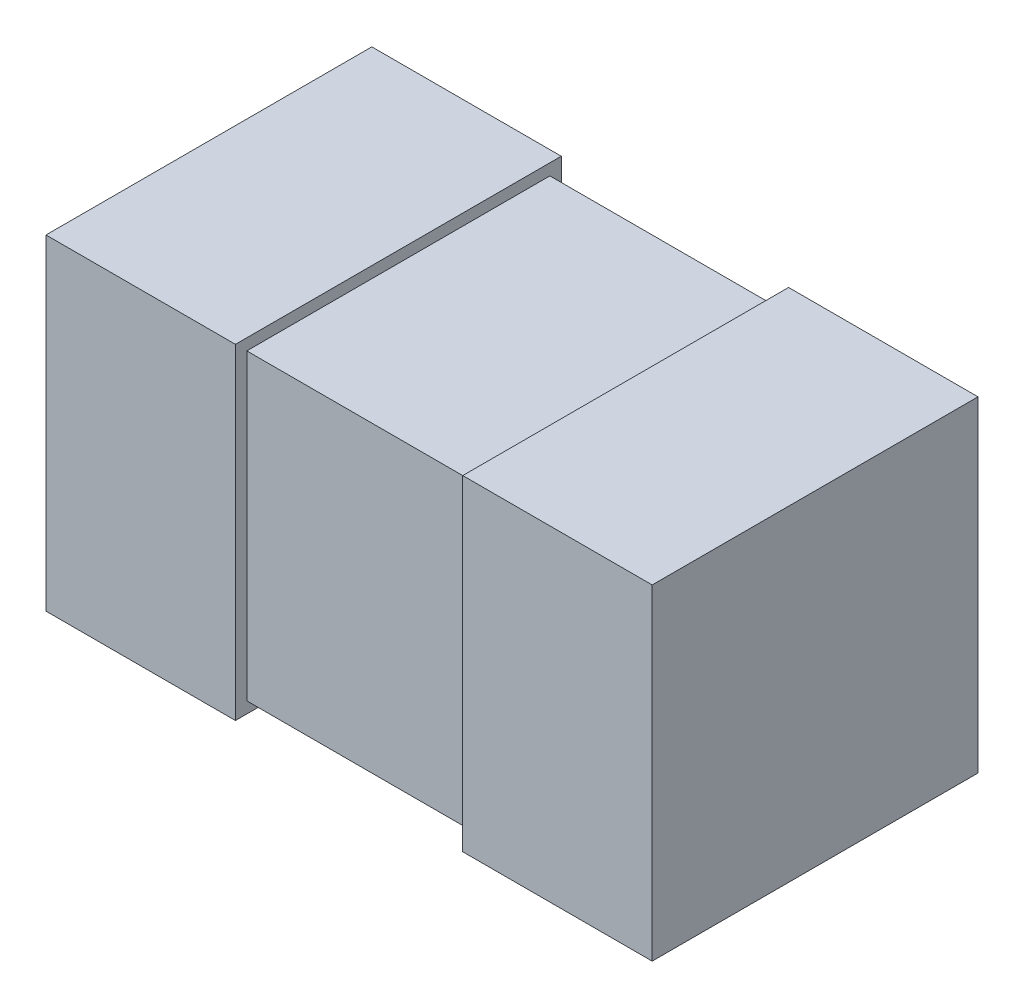
ISO-10303-21;
HEADER;
FILE_DESCRIPTION(('STEP AP214'),'2;1');
FILE_NAME('part.step','',(''),(''),'','','');
FILE_SCHEMA(('AUTOMOTIVE_DESIGN { 1 0 10303 214 1 1 1 1 }'));
ENDSEC;
DATA;
#1=APPLICATION_CONTEXT('core data for automotive mechanical design processes');
#2=APPLICATION_PROTOCOL_DEFINITION('international standard','automotive_design',2000,#1);
#3=PRODUCT_CONTEXT('',#1,'mechanical');
#4=PRODUCT('Part','Part','',(#3));
#5=PRODUCT_RELATED_PRODUCT_CATEGORY('part','',(#4));
#6=PRODUCT_DEFINITION_FORMATION('','',#4);
#7=PRODUCT_DEFINITION_CONTEXT('part definition',#1,'design');
#8=PRODUCT_DEFINITION('design','',#6,#7);
#9=PRODUCT_DEFINITION_SHAPE('','',#8);
#10=(LENGTH_UNIT() NAMED_UNIT(*) SI_UNIT(.MILLI.,.METRE.));
#11=(NAMED_UNIT(*) PLANE_ANGLE_UNIT() SI_UNIT($,.RADIAN.));
#12=(NAMED_UNIT(*) SI_UNIT($,.STERADIAN.) SOLID_ANGLE_UNIT());
#13=UNCERTAINTY_MEASURE_WITH_UNIT(LENGTH_MEASURE(1.E-05),#10,'distance_accuracy_value','');
#14=(GEOMETRIC_REPRESENTATION_CONTEXT(3) GLOBAL_UNCERTAINTY_ASSIGNED_CONTEXT((#13)) GLOBAL_UNIT_ASSIGNED_CONTEXT((#10,
#11,#12)) REPRESENTATION_CONTEXT('',''));
#15=CARTESIAN_POINT('',(0.,0.,0.));
#16=DIRECTION('',(0.,0.,1.));
#17=DIRECTION('',(1.,0.,0.));
#18=AXIS2_PLACEMENT_3D('',#15,#16,#17);
#19=CARTESIAN_POINT('',(-0.8,0.8,0.4));
#20=DIRECTION('',(0.,0.,-1.));
#21=DIRECTION('',(-1.,0.,0.));
#22=AXIS2_PLACEMENT_3D('',#19,#20,#21);
#23=PLANE('',#22);
#24=DIRECTION('',(0.,-1.,0.));
#25=VECTOR('',#24,1.);
#26=CARTESIAN_POINT('',(0.299999999999999,0.8,0.4));
#27=LINE('',#26,#25);
#28=CARTESIAN_POINT('',(0.299999999999999,0.8,0.4));
#29=VERTEX_POINT('',#28);
#30=CARTESIAN_POINT('',(0.299999999999999,0.,0.4));
#31=VERTEX_POINT('',#30);
#32=EDGE_CURVE('E51',#29,#31,#27,.T.);
#33=ORIENTED_EDGE('',*,*,#32,.F.);
#34=DIRECTION('',(1.,0.,0.));
#35=VECTOR('',#34,1.);
#36=CARTESIAN_POINT('',(-0.8,0.8,0.4));
#37=LINE('',#36,#35);
#38=CARTESIAN_POINT('',(-0.3,0.8,0.4));
#39=VERTEX_POINT('',#38);
#40=EDGE_CURVE('E216',#39,#29,#37,.T.);
#41=ORIENTED_EDGE('',*,*,#40,.F.);
#42=DIRECTION('',(0.,1.,0.));
#43=VECTOR('',#42,1.);
#44=CARTESIAN_POINT('',(-0.3,0.8,0.4));
#45=LINE('',#44,#43);
#46=CARTESIAN_POINT('',(-0.3,0.,0.4));
#47=VERTEX_POINT('',#46);
#48=EDGE_CURVE('E210',#47,#39,#45,.T.);
#49=ORIENTED_EDGE('',*,*,#48,.F.);
#50=DIRECTION('',(1.,0.,0.));
#51=VECTOR('',#50,1.);
#52=CARTESIAN_POINT('',(-0.8,0.,0.4));
#53=LINE('',#52,#51);
#54=EDGE_CURVE('E215',#47,#31,#53,.T.);
#55=ORIENTED_EDGE('',*,*,#54,.T.);
#56=EDGE_LOOP('',(#33,#41,#49,#55));
#57=FACE_BOUND('',#56,.T.);
#58=ADVANCED_FACE('F36',(#57),#23,.F.);
#59=CARTESIAN_POINT('',(-0.8,0.8,-0.4));
#60=DIRECTION('',(0.,0.,1.));
#61=DIRECTION('',(1.,0.,0.));
#62=AXIS2_PLACEMENT_3D('',#59,#60,#61);
#63=PLANE('',#62);
#64=DIRECTION('',(0.,1.,0.));
#65=VECTOR('',#64,1.);
#66=CARTESIAN_POINT('',(0.3,0.8,-0.4));
#67=LINE('',#66,#65);
#68=CARTESIAN_POINT('',(0.3,0.,-0.4));
#69=VERTEX_POINT('',#68);
#70=CARTESIAN_POINT('',(0.3,0.8,-0.4));
#71=VERTEX_POINT('',#70);
#72=EDGE_CURVE('E165',#69,#71,#67,.T.);
#73=ORIENTED_EDGE('',*,*,#72,.F.);
#74=DIRECTION('',(-1.,0.,0.));
#75=VECTOR('',#74,1.);
#76=CARTESIAN_POINT('',(-0.8,0.,-0.4));
#77=LINE('',#76,#75);
#78=CARTESIAN_POINT('',(-0.3,0.,-0.4));
#79=VERTEX_POINT('',#78);
#80=EDGE_CURVE('E219',#69,#79,#77,.T.);
#81=ORIENTED_EDGE('',*,*,#80,.T.);
#82=DIRECTION('',(0.,-1.,0.));
#83=VECTOR('',#82,1.);
#84=CARTESIAN_POINT('',(-0.3,0.8,-0.4));
#85=LINE('',#84,#83);
#86=CARTESIAN_POINT('',(-0.3,0.8,-0.4));
#87=VERTEX_POINT('',#86);
#88=EDGE_CURVE('E198',#87,#79,#85,.T.);
#89=ORIENTED_EDGE('',*,*,#88,.F.);
#90=DIRECTION('',(-1.,0.,0.));
#91=VECTOR('',#90,1.);
#92=CARTESIAN_POINT('',(-0.8,0.8,-0.4));
#93=LINE('',#92,#91);
#94=EDGE_CURVE('E218',#71,#87,#93,.T.);
#95=ORIENTED_EDGE('',*,*,#94,.F.);
#96=EDGE_LOOP('',(#73,#81,#89,#95));
#97=FACE_BOUND('',#96,.T.);
#98=ADVANCED_FACE('F236',(#97),#63,.F.);
#99=CARTESIAN_POINT('',(-0.8,0.8,0.4));
#100=DIRECTION('',(0.,1.,0.));
#101=DIRECTION('',(0.,0.,1.));
#102=AXIS2_PLACEMENT_3D('',#99,#100,#101);
#103=PLANE('',#102);
#104=ORIENTED_EDGE('',*,*,#40,.T.);
#105=DIRECTION('',(0.,0.,-1.));
#106=VECTOR('',#105,1.);
#107=CARTESIAN_POINT('',(0.3,0.8,0.4));
#108=LINE('',#107,#106);
#109=EDGE_CURVE('E58',#29,#71,#108,.T.);
#110=ORIENTED_EDGE('',*,*,#109,.T.);
#111=ORIENTED_EDGE('',*,*,#94,.T.);
#112=DIRECTION('',(0.,0.,1.));
#113=VECTOR('',#112,1.);
#114=CARTESIAN_POINT('',(-0.3,0.8,0.4));
#115=LINE('',#114,#113);
#116=EDGE_CURVE('E213',#87,#39,#115,.T.);
#117=ORIENTED_EDGE('',*,*,#116,.T.);
#118=EDGE_LOOP('',(#104,#110,#111,#117));
#119=FACE_BOUND('',#118,.T.);
#120=ADVANCED_FACE('F233',(#119),#103,.T.);
#121=CARTESIAN_POINT('',(-0.8,0.,0.4));
#122=DIRECTION('',(0.,1.,0.));
#123=DIRECTION('',(0.,0.,1.));
#124=AXIS2_PLACEMENT_3D('',#121,#122,#123);
#125=PLANE('',#124);
#126=DIRECTION('',(0.,0.,-1.));
#127=VECTOR('',#126,1.);
#128=CARTESIAN_POINT('',(0.3,0.,0.4));
#129=LINE('',#128,#127);
#130=EDGE_CURVE('E12',#31,#69,#129,.T.);
#131=ORIENTED_EDGE('',*,*,#130,.F.);
#132=ORIENTED_EDGE('',*,*,#54,.F.);
#133=DIRECTION('',(0.,0.,1.));
#134=VECTOR('',#133,1.);
#135=CARTESIAN_POINT('',(-0.3,0.,0.4));
#136=LINE('',#135,#134);
#137=EDGE_CURVE('E44',#79,#47,#136,.T.);
#138=ORIENTED_EDGE('',*,*,#137,.F.);
#139=ORIENTED_EDGE('',*,*,#80,.F.);
#140=EDGE_LOOP('',(#131,#132,#138,#139));
#141=FACE_BOUND('',#140,.T.);
#142=ADVANCED_FACE('F231',(#141),#125,.F.);
#143=CARTESIAN_POINT('',(-0.3,-0.03,1.45478640923567));
#144=DIRECTION('',(0.,1.,0.));
#145=DIRECTION('',(-1.,0.,0.));
#146=AXIS2_PLACEMENT_3D('',#143,#144,#145);
#147=PLANE('',#146);
#148=DIRECTION('',(0.,0.,-1.));
#149=VECTOR('',#148,1.);
#150=CARTESIAN_POINT('',(-0.3,-0.03,1.45478640923567));
#151=LINE('',#150,#149);
#152=CARTESIAN_POINT('',(-0.3,-0.03,0.43));
#153=VERTEX_POINT('',#152);
#154=CARTESIAN_POINT('',(-0.3,-0.03,-0.43));
#155=VERTEX_POINT('',#154);
#156=EDGE_CURVE('E187',#153,#155,#151,.T.);
#157=ORIENTED_EDGE('',*,*,#156,.F.);
#158=DIRECTION('',(-1.,0.,0.));
#159=VECTOR('',#158,1.);
#160=CARTESIAN_POINT('',(-0.3,-0.03,0.43));
#161=LINE('',#160,#159);
#162=CARTESIAN_POINT('',(-0.8,-0.03,0.43));
#163=VERTEX_POINT('',#162);
#164=EDGE_CURVE('E192',#153,#163,#161,.T.);
#165=ORIENTED_EDGE('',*,*,#164,.T.);
#166=DIRECTION('',(0.,0.,-1.));
#167=VECTOR('',#166,1.);
#168=CARTESIAN_POINT('',(-0.8,-0.03,1.45478640923567));
#169=LINE('',#168,#167);
#170=CARTESIAN_POINT('',(-0.8,-0.03,-0.43));
#171=VERTEX_POINT('',#170);
#172=EDGE_CURVE('E200',#163,#171,#169,.T.);
#173=ORIENTED_EDGE('',*,*,#172,.T.);
#174=DIRECTION('',(-1.,0.,0.));
#175=VECTOR('',#174,1.);
#176=CARTESIAN_POINT('',(-0.3,-0.03,-0.43));
#177=LINE('',#176,#175);
#178=EDGE_CURVE('E178',#155,#171,#177,.T.);
#179=ORIENTED_EDGE('',*,*,#178,.F.);
#180=EDGE_LOOP('',(#157,#165,#173,#179));
#181=FACE_BOUND('',#180,.T.);
#182=ADVANCED_FACE('F277',(#181),#147,.F.);
#183=CARTESIAN_POINT('',(-0.3,0.83,1.45478640923567));
#184=DIRECTION('',(0.,-1.,0.));
#185=DIRECTION('',(1.,0.,0.));
#186=AXIS2_PLACEMENT_3D('',#183,#184,#185);
#187=PLANE('',#186);
#188=DIRECTION('',(0.,0.,-1.));
#189=VECTOR('',#188,1.);
#190=CARTESIAN_POINT('',(-0.8,0.83,1.45478640923567));
#191=LINE('',#190,#189);
#192=CARTESIAN_POINT('',(-0.8,0.83,0.43));
#193=VERTEX_POINT('',#192);
#194=CARTESIAN_POINT('',(-0.8,0.83,-0.43));
#195=VERTEX_POINT('',#194);
#196=EDGE_CURVE('E202',#193,#195,#191,.T.);
#197=ORIENTED_EDGE('',*,*,#196,.F.);
#198=DIRECTION('',(1.,0.,0.));
#199=VECTOR('',#198,1.);
#200=CARTESIAN_POINT('',(-0.3,0.83,0.43));
#201=LINE('',#200,#199);
#202=CARTESIAN_POINT('',(-0.3,0.83,0.43));
#203=VERTEX_POINT('',#202);
#204=EDGE_CURVE('E191',#193,#203,#201,.T.);
#205=ORIENTED_EDGE('',*,*,#204,.T.);
#206=DIRECTION('',(0.,0.,-1.));
#207=VECTOR('',#206,1.);
#208=CARTESIAN_POINT('',(-0.3,0.83,1.45478640923567));
#209=LINE('',#208,#207);
#210=CARTESIAN_POINT('',(-0.3,0.83,-0.43));
#211=VERTEX_POINT('',#210);
#212=EDGE_CURVE('E204',#203,#211,#209,.T.);
#213=ORIENTED_EDGE('',*,*,#212,.T.);
#214=DIRECTION('',(1.,0.,0.));
#215=VECTOR('',#214,1.);
#216=CARTESIAN_POINT('',(-0.3,0.83,-0.43));
#217=LINE('',#216,#215);
#218=EDGE_CURVE('E184',#195,#211,#217,.T.);
#219=ORIENTED_EDGE('',*,*,#218,.F.);
#220=EDGE_LOOP('',(#197,#205,#213,#219));
#221=FACE_BOUND('',#220,.T.);
#222=ADVANCED_FACE('F280',(#221),#187,.F.);
#223=CARTESIAN_POINT('',(-0.3,0.83,1.45478640923567));
#224=DIRECTION('',(-1.,0.,0.));
#225=DIRECTION('',(0.,-1.,0.));
#226=AXIS2_PLACEMENT_3D('',#223,#224,#225);
#227=PLANE('',#226);
#228=ORIENTED_EDGE('',*,*,#116,.F.);
#229=ORIENTED_EDGE('',*,*,#88,.T.);
#230=ORIENTED_EDGE('',*,*,#137,.T.);
#231=ORIENTED_EDGE('',*,*,#48,.T.);
#232=EDGE_LOOP('',(#228,#229,#230,#231));
#233=FACE_BOUND('',#232,.T.);
#234=ORIENTED_EDGE('',*,*,#212,.F.);
#235=DIRECTION('',(0.,-1.,0.));
#236=VECTOR('',#235,1.);
#237=CARTESIAN_POINT('',(-0.3,0.83,0.43));
#238=LINE('',#237,#236);
#239=EDGE_CURVE('E195',#203,#153,#238,.T.);
#240=ORIENTED_EDGE('',*,*,#239,.T.);
#241=ORIENTED_EDGE('',*,*,#156,.T.);
#242=DIRECTION('',(0.,-1.,0.));
#243=VECTOR('',#242,1.);
#244=CARTESIAN_POINT('',(-0.3,0.83,-0.43));
#245=LINE('',#244,#243);
#246=EDGE_CURVE('E181',#211,#155,#245,.T.);
#247=ORIENTED_EDGE('',*,*,#246,.F.);
#248=EDGE_LOOP('',(#234,#240,#241,#247));
#249=FACE_BOUND('',#248,.T.);
#250=ADVANCED_FACE('F226',(#233,#249),#227,.F.);
#251=CARTESIAN_POINT('',(-0.8,0.8,0.43));
#252=DIRECTION('',(0.,0.,-1.));
#253=DIRECTION('',(-1.,0.,0.));
#254=AXIS2_PLACEMENT_3D('',#251,#252,#253);
#255=PLANE('',#254);
#256=ORIENTED_EDGE('',*,*,#204,.F.);
#257=DIRECTION('',(0.,1.,0.));
#258=VECTOR('',#257,1.);
#259=CARTESIAN_POINT('',(-0.8,0.83,0.43));
#260=LINE('',#259,#258);
#261=EDGE_CURVE('E188',#163,#193,#260,.T.);
#262=ORIENTED_EDGE('',*,*,#261,.F.);
#263=ORIENTED_EDGE('',*,*,#164,.F.);
#264=ORIENTED_EDGE('',*,*,#239,.F.);
#265=EDGE_LOOP('',(#256,#262,#263,#264));
#266=FACE_BOUND('',#265,.T.);
#267=ADVANCED_FACE('F272',(#266),#255,.F.);
#268=CARTESIAN_POINT('',(-0.8,0.8,-0.43));
#269=DIRECTION('',(0.,0.,1.));
#270=DIRECTION('',(1.,0.,0.));
#271=AXIS2_PLACEMENT_3D('',#268,#269,#270);
#272=PLANE('',#271);
#273=ORIENTED_EDGE('',*,*,#246,.T.);
#274=ORIENTED_EDGE('',*,*,#178,.T.);
#275=DIRECTION('',(0.,1.,0.));
#276=VECTOR('',#275,1.);
#277=CARTESIAN_POINT('',(-0.8,0.83,-0.43));
#278=LINE('',#277,#276);
#279=EDGE_CURVE('E175',#171,#195,#278,.T.);
#280=ORIENTED_EDGE('',*,*,#279,.T.);
#281=ORIENTED_EDGE('',*,*,#218,.T.);
#282=EDGE_LOOP('',(#273,#274,#280,#281));
#283=FACE_BOUND('',#282,.T.);
#284=ADVANCED_FACE('F269',(#283),#272,.F.);
#285=CARTESIAN_POINT('',(-0.8,0.8,-0.4));
#286=DIRECTION('',(1.,0.,0.));
#287=DIRECTION('',(0.,0.,-1.));
#288=AXIS2_PLACEMENT_3D('',#285,#286,#287);
#289=PLANE('',#288);
#290=ORIENTED_EDGE('',*,*,#172,.F.);
#291=ORIENTED_EDGE('',*,*,#261,.T.);
#292=ORIENTED_EDGE('',*,*,#196,.T.);
#293=ORIENTED_EDGE('',*,*,#279,.F.);
#294=EDGE_LOOP('',(#290,#291,#292,#293));
#295=FACE_BOUND('',#294,.T.);
#296=ADVANCED_FACE('F38',(#295),#289,.F.);
#297=CARTESIAN_POINT('',(0.3,-0.0299999999999999,1.45478640923567));
#298=DIRECTION('',(0.,1.,0.));
#299=DIRECTION('',(-1.,0.,0.));
#300=AXIS2_PLACEMENT_3D('',#297,#298,#299);
#301=PLANE('',#300);
#302=DIRECTION('',(0.,0.,-1.));
#303=VECTOR('',#302,1.);
#304=CARTESIAN_POINT('',(0.8,-0.0299999999999998,1.45478640923567));
#305=LINE('',#304,#303);
#306=CARTESIAN_POINT('',(0.8,-0.0299999999999998,0.43));
#307=VERTEX_POINT('',#306);
#308=CARTESIAN_POINT('',(0.8,-0.0299999999999998,-0.43));
#309=VERTEX_POINT('',#308);
#310=EDGE_CURVE('E138',#307,#309,#305,.T.);
#311=ORIENTED_EDGE('',*,*,#310,.F.);
#312=DIRECTION('',(-1.,0.,0.));
#313=VECTOR('',#312,1.);
#314=CARTESIAN_POINT('',(0.3,-0.0299999999999999,0.43));
#315=LINE('',#314,#313);
#316=CARTESIAN_POINT('',(0.3,-0.0299999999999999,0.43));
#317=VERTEX_POINT('',#316);
#318=EDGE_CURVE('E133',#307,#317,#315,.T.);
#319=ORIENTED_EDGE('',*,*,#318,.T.);
#320=DIRECTION('',(0.,0.,-1.));
#321=VECTOR('',#320,1.);
#322=CARTESIAN_POINT('',(0.3,-0.0299999999999999,1.45478640923567));
#323=LINE('',#322,#321);
#324=CARTESIAN_POINT('',(0.3,-0.0299999999999999,-0.43));
#325=VERTEX_POINT('',#324);
#326=EDGE_CURVE('E128',#317,#325,#323,.T.);
#327=ORIENTED_EDGE('',*,*,#326,.T.);
#328=DIRECTION('',(-1.,0.,0.));
#329=VECTOR('',#328,1.);
#330=CARTESIAN_POINT('',(0.3,-0.0299999999999999,-0.43));
#331=LINE('',#330,#329);
#332=EDGE_CURVE('E132',#309,#325,#331,.T.);
#333=ORIENTED_EDGE('',*,*,#332,.F.);
#334=EDGE_LOOP('',(#311,#319,#327,#333));
#335=FACE_BOUND('',#334,.T.);
#336=ADVANCED_FACE('F131',(#335),#301,.F.);
#337=CARTESIAN_POINT('',(0.3,0.83,1.45478640923567));
#338=DIRECTION('',(1.,0.,0.));
#339=DIRECTION('',(0.,0.,-1.));
#340=AXIS2_PLACEMENT_3D('',#337,#338,#339);
#341=PLANE('',#340);
#342=ORIENTED_EDGE('',*,*,#109,.F.);
#343=ORIENTED_EDGE('',*,*,#32,.T.);
#344=ORIENTED_EDGE('',*,*,#130,.T.);
#345=ORIENTED_EDGE('',*,*,#72,.T.);
#346=EDGE_LOOP('',(#342,#343,#344,#345));
#347=FACE_BOUND('',#346,.T.);
#348=ORIENTED_EDGE('',*,*,#326,.F.);
#349=DIRECTION('',(0.,1.,0.));
#350=VECTOR('',#349,1.);
#351=CARTESIAN_POINT('',(0.3,0.83,0.43));
#352=LINE('',#351,#350);
#353=CARTESIAN_POINT('',(0.3,0.83,0.43));
#354=VERTEX_POINT('',#353);
#355=EDGE_CURVE('E160',#317,#354,#352,.T.);
#356=ORIENTED_EDGE('',*,*,#355,.T.);
#357=DIRECTION('',(0.,0.,-1.));
#358=VECTOR('',#357,1.);
#359=CARTESIAN_POINT('',(0.3,0.83,1.45478640923567));
#360=LINE('',#359,#358);
#361=CARTESIAN_POINT('',(0.3,0.83,-0.43));
#362=VERTEX_POINT('',#361);
#363=EDGE_CURVE('E137',#354,#362,#360,.T.);
#364=ORIENTED_EDGE('',*,*,#363,.T.);
#365=DIRECTION('',(0.,1.,0.));
#366=VECTOR('',#365,1.);
#367=CARTESIAN_POINT('',(0.3,0.83,-0.43));
#368=LINE('',#367,#366);
#369=EDGE_CURVE('E145',#325,#362,#368,.T.);
#370=ORIENTED_EDGE('',*,*,#369,.F.);
#371=EDGE_LOOP('',(#348,#356,#364,#370));
#372=FACE_BOUND('',#371,.T.);
#373=ADVANCED_FACE('F150',(#347,#372),#341,.F.);
#374=CARTESIAN_POINT('',(0.3,0.83,1.45478640923567));
#375=DIRECTION('',(0.,-1.,0.));
#376=DIRECTION('',(0.,0.,-1.));
#377=AXIS2_PLACEMENT_3D('',#374,#375,#376);
#378=PLANE('',#377);
#379=ORIENTED_EDGE('',*,*,#363,.F.);
#380=DIRECTION('',(1.,0.,0.));
#381=VECTOR('',#380,1.);
#382=CARTESIAN_POINT('',(0.3,0.83,0.43));
#383=LINE('',#382,#381);
#384=CARTESIAN_POINT('',(0.8,0.83,0.43));
#385=VERTEX_POINT('',#384);
#386=EDGE_CURVE('E163',#354,#385,#383,.T.);
#387=ORIENTED_EDGE('',*,*,#386,.T.);
#388=DIRECTION('',(0.,0.,-1.));
#389=VECTOR('',#388,1.);
#390=CARTESIAN_POINT('',(0.8,0.83,1.45478640923567));
#391=LINE('',#390,#389);
#392=CARTESIAN_POINT('',(0.8,0.83,-0.43));
#393=VERTEX_POINT('',#392);
#394=EDGE_CURVE('E152',#385,#393,#391,.T.);
#395=ORIENTED_EDGE('',*,*,#394,.T.);
#396=DIRECTION('',(1.,0.,0.));
#397=VECTOR('',#396,1.);
#398=CARTESIAN_POINT('',(0.3,0.83,-0.43));
#399=LINE('',#398,#397);
#400=EDGE_CURVE('E153',#362,#393,#399,.T.);
#401=ORIENTED_EDGE('',*,*,#400,.F.);
#402=EDGE_LOOP('',(#379,#387,#395,#401));
#403=FACE_BOUND('',#402,.T.);
#404=ADVANCED_FACE('F256',(#403),#378,.F.);
#405=CARTESIAN_POINT('',(-0.8,0.8,0.43));
#406=DIRECTION('',(0.,0.,-1.));
#407=DIRECTION('',(-1.,0.,0.));
#408=AXIS2_PLACEMENT_3D('',#405,#406,#407);
#409=PLANE('',#408);
#410=ORIENTED_EDGE('',*,*,#355,.F.);
#411=ORIENTED_EDGE('',*,*,#318,.F.);
#412=DIRECTION('',(0.,-1.,0.));
#413=VECTOR('',#412,1.);
#414=CARTESIAN_POINT('',(0.8,0.83,0.43));
#415=LINE('',#414,#413);
#416=EDGE_CURVE('E161',#385,#307,#415,.T.);
#417=ORIENTED_EDGE('',*,*,#416,.F.);
#418=ORIENTED_EDGE('',*,*,#386,.F.);
#419=EDGE_LOOP('',(#410,#411,#417,#418));
#420=FACE_BOUND('',#419,.T.);
#421=ADVANCED_FACE('F252',(#420),#409,.F.);
#422=CARTESIAN_POINT('',(-0.8,0.8,-0.43));
#423=DIRECTION('',(0.,0.,1.));
#424=DIRECTION('',(1.,0.,0.));
#425=AXIS2_PLACEMENT_3D('',#422,#423,#424);
#426=PLANE('',#425);
#427=ORIENTED_EDGE('',*,*,#400,.T.);
#428=DIRECTION('',(0.,-1.,0.));
#429=VECTOR('',#428,1.);
#430=CARTESIAN_POINT('',(0.8,0.83,-0.43));
#431=LINE('',#430,#429);
#432=EDGE_CURVE('E148',#393,#309,#431,.T.);
#433=ORIENTED_EDGE('',*,*,#432,.T.);
#434=ORIENTED_EDGE('',*,*,#332,.T.);
#435=ORIENTED_EDGE('',*,*,#369,.T.);
#436=EDGE_LOOP('',(#427,#433,#434,#435));
#437=FACE_BOUND('',#436,.T.);
#438=ADVANCED_FACE('F144',(#437),#426,.F.);
#439=CARTESIAN_POINT('',(0.8,0.8,-0.4));
#440=DIRECTION('',(-1.,0.,0.));
#441=DIRECTION('',(0.,0.,1.));
#442=AXIS2_PLACEMENT_3D('',#439,#440,#441);
#443=PLANE('',#442);
#444=ORIENTED_EDGE('',*,*,#394,.F.);
#445=ORIENTED_EDGE('',*,*,#416,.T.);
#446=ORIENTED_EDGE('',*,*,#310,.T.);
#447=ORIENTED_EDGE('',*,*,#432,.F.);
#448=EDGE_LOOP('',(#444,#445,#446,#447));
#449=FACE_BOUND('',#448,.T.);
#450=ADVANCED_FACE('F246',(#449),#443,.F.);
#451=CLOSED_SHELL('',(#58,#98,#120,#142,#182,#222,#250,#267,#284,#296,#336,#373,#404,#421,#438,#450));
#452=MANIFOLD_SOLID_BREP('B2',#451);
#453=ADVANCED_BREP_SHAPE_REPRESENTATION('',(#18,#452),#14);
#454=SHAPE_DEFINITION_REPRESENTATION(#9,#453);
ENDSEC;
END-ISO-10303-21;
